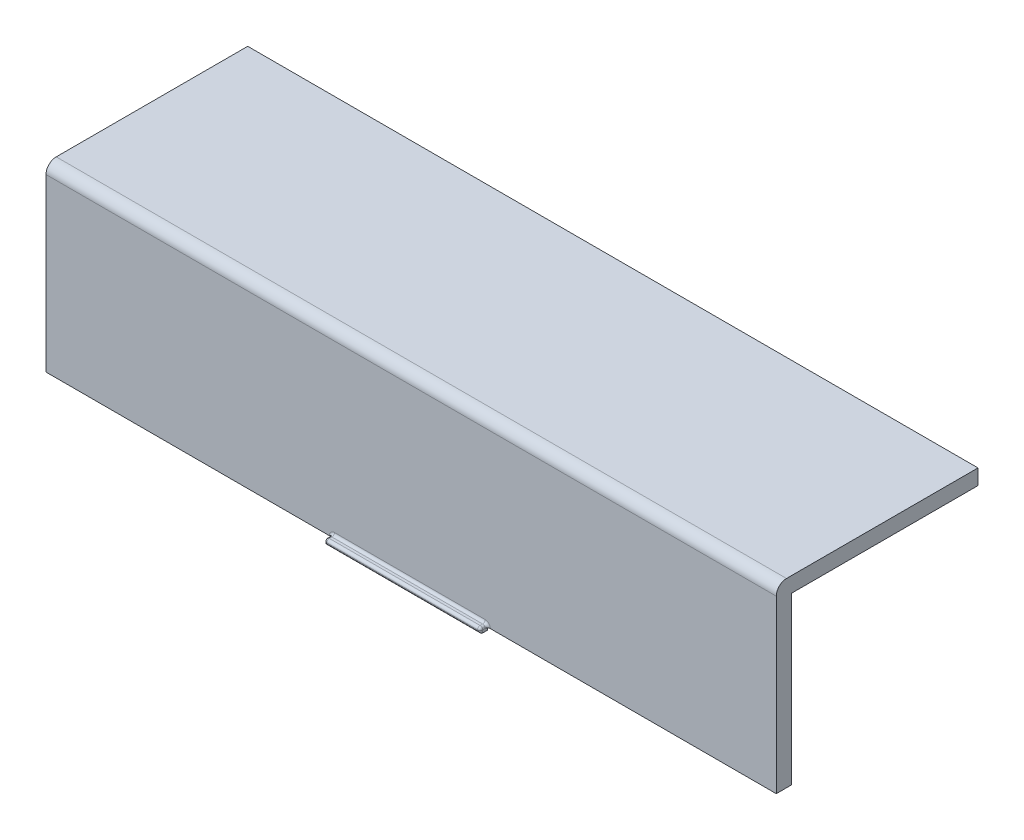
ISO-10303-21;
HEADER;
FILE_DESCRIPTION(('STEP AP214'),'2;1');
FILE_NAME('part.step','',(''),(''),'','','');
FILE_SCHEMA(('AUTOMOTIVE_DESIGN { 1 0 10303 214 1 1 1 1 }'));
ENDSEC;
DATA;
#1=APPLICATION_CONTEXT('core data for automotive mechanical design processes');
#2=APPLICATION_PROTOCOL_DEFINITION('international standard','automotive_design',2000,#1);
#3=PRODUCT_CONTEXT('',#1,'mechanical');
#4=PRODUCT('Part','Part','',(#3));
#5=PRODUCT_RELATED_PRODUCT_CATEGORY('part','',(#4));
#6=PRODUCT_DEFINITION_FORMATION('','',#4);
#7=PRODUCT_DEFINITION_CONTEXT('part definition',#1,'design');
#8=PRODUCT_DEFINITION('design','',#6,#7);
#9=PRODUCT_DEFINITION_SHAPE('','',#8);
#10=(LENGTH_UNIT() NAMED_UNIT(*) SI_UNIT(.MILLI.,.METRE.));
#11=(NAMED_UNIT(*) PLANE_ANGLE_UNIT() SI_UNIT($,.RADIAN.));
#12=(NAMED_UNIT(*) SI_UNIT($,.STERADIAN.) SOLID_ANGLE_UNIT());
#13=UNCERTAINTY_MEASURE_WITH_UNIT(LENGTH_MEASURE(1.E-05),#10,'distance_accuracy_value','');
#14=(GEOMETRIC_REPRESENTATION_CONTEXT(3) GLOBAL_UNCERTAINTY_ASSIGNED_CONTEXT((#13)) GLOBAL_UNIT_ASSIGNED_CONTEXT((#10,
#11,#12)) REPRESENTATION_CONTEXT('',''));
#15=CARTESIAN_POINT('',(0.,0.,0.));
#16=DIRECTION('',(0.,0.,1.));
#17=DIRECTION('',(1.,0.,0.));
#18=AXIS2_PLACEMENT_3D('',#15,#16,#17);
#19=CARTESIAN_POINT('',(-10.5625000000706,-0.499999999999987,41.5));
#20=DIRECTION('',(0.,0.,1.));
#21=DIRECTION('',(1.,0.,0.));
#22=AXIS2_PLACEMENT_3D('',#19,#20,#21);
#23=PLANE('',#22);
#24=DIRECTION('',(0.,1.,0.));
#25=VECTOR('',#24,1.);
#26=CARTESIAN_POINT('',(-10.0625000000706,-0.499999999999987,41.5));
#27=LINE('',#26,#25);
#28=CARTESIAN_POINT('',(-10.0625000000706,0.0307991543217241,41.5));
#29=VERTEX_POINT('',#28);
#30=CARTESIAN_POINT('',(-10.0625000000706,0.,41.5));
#31=VERTEX_POINT('',#30);
#32=EDGE_CURVE('E118',#29,#31,#27,.F.);
#33=ORIENTED_EDGE('',*,*,#32,.T.);
#34=DIRECTION('',(-1.,0.,0.));
#35=VECTOR('',#34,1.);
#36=CARTESIAN_POINT('',(-10.5625000000706,0.,41.5));
#37=LINE('',#36,#35);
#38=CARTESIAN_POINT('',(19.4374999999293,0.,41.5));
#39=VERTEX_POINT('',#38);
#40=EDGE_CURVE('E115',#39,#31,#37,.T.);
#41=ORIENTED_EDGE('',*,*,#40,.F.);
#42=DIRECTION('',(0.,1.,0.));
#43=VECTOR('',#42,1.);
#44=CARTESIAN_POINT('',(19.4374999999293,-0.499999999999987,41.5));
#45=LINE('',#44,#43);
#46=CARTESIAN_POINT('',(19.4374999999293,0.0307991543217248,41.5));
#47=VERTEX_POINT('',#46);
#48=EDGE_CURVE('E91',#39,#47,#45,.T.);
#49=ORIENTED_EDGE('',*,*,#48,.T.);
#50=DIRECTION('',(1.,0.,0.));
#51=VECTOR('',#50,1.);
#52=CARTESIAN_POINT('',(-10.5625000000706,0.0307991543217241,41.5));
#53=LINE('',#52,#51);
#54=EDGE_CURVE('E126',#29,#47,#53,.T.);
#55=ORIENTED_EDGE('',*,*,#54,.F.);
#56=EDGE_LOOP('',(#33,#41,#49,#55));
#57=FACE_BOUND('',#56,.T.);
#58=ADVANCED_FACE('F17',(#57),#23,.T.);
#59=CARTESIAN_POINT('',(-10.5625000000706,0.,41.));
#60=DIRECTION('',(-1.,0.,0.));
#61=DIRECTION('',(0.,0.,1.));
#62=AXIS2_PLACEMENT_3D('',#59,#60,#61);
#63=CYLINDRICAL_SURFACE('',#62,0.5);
#64=CARTESIAN_POINT('',(19.4374999999293,0.,41.));
#65=DIRECTION('',(-0.707106781186547,-0.707106781186547,0.));
#66=DIRECTION('',(-0.707106781186547,0.707106781186547,0.));
#67=AXIS2_PLACEMENT_3D('',#64,#65,#66);
#68=ELLIPSE('',#67,0.707106781186547,0.5);
#69=CARTESIAN_POINT('',(19.9374999999293,-0.499999999999985,41.));
#70=VERTEX_POINT('',#69);
#71=EDGE_CURVE('E20',#70,#39,#68,.T.);
#72=ORIENTED_EDGE('',*,*,#71,.T.);
#73=ORIENTED_EDGE('',*,*,#40,.T.);
#74=CARTESIAN_POINT('',(-10.0625000000706,0.,41.));
#75=DIRECTION('',(-0.707106781186547,0.707106781186547,0.));
#76=DIRECTION('',(0.707106781186547,0.707106781186547,0.));
#77=AXIS2_PLACEMENT_3D('',#74,#75,#76);
#78=ELLIPSE('',#77,0.707106781186547,0.5);
#79=CARTESIAN_POINT('',(-10.5625000000706,-0.499999999999987,41.));
#80=VERTEX_POINT('',#79);
#81=EDGE_CURVE('E157',#80,#31,#78,.T.);
#82=ORIENTED_EDGE('',*,*,#81,.F.);
#83=DIRECTION('',(1.,0.,0.));
#84=VECTOR('',#83,1.);
#85=CARTESIAN_POINT('',(-10.5625000000706,-0.499999999999987,41.));
#86=LINE('',#85,#84);
#87=EDGE_CURVE('E117',#80,#70,#86,.T.);
#88=ORIENTED_EDGE('',*,*,#87,.T.);
#89=EDGE_LOOP('',(#72,#73,#82,#88));
#90=FACE_BOUND('',#89,.T.);
#91=ADVANCED_FACE('F113',(#90),#63,.T.);
#92=CARTESIAN_POINT('',(-10.0625000000706,0.030799154321724,41.));
#93=DIRECTION('',(1.,0.,0.));
#94=DIRECTION('',(0.,1.,0.));
#95=AXIS2_PLACEMENT_3D('',#92,#93,#94);
#96=SPHERICAL_SURFACE('',#95,0.5);
#97=CARTESIAN_POINT('',(-10.0625000000706,0.030799154321724,41.));
#98=DIRECTION('',(0.,1.,0.));
#99=DIRECTION('',(0.,0.,1.));
#100=AXIS2_PLACEMENT_3D('',#97,#98,#99);
#101=CIRCLE('',#100,0.5);
#102=CARTESIAN_POINT('',(-10.5625000000706,0.030799154321724,41.));
#103=VERTEX_POINT('',#102);
#104=EDGE_CURVE('E158',#29,#103,#101,.F.);
#105=ORIENTED_EDGE('',*,*,#104,.F.);
#106=CARTESIAN_POINT('',(-10.0625000000706,0.030799154321724,41.));
#107=DIRECTION('',(1.,0.,0.));
#108=DIRECTION('',(0.,0.,-1.));
#109=AXIS2_PLACEMENT_3D('',#106,#107,#108);
#110=CIRCLE('',#109,0.5);
#111=CARTESIAN_POINT('',(-10.0625000000706,0.530799154321724,41.));
#112=VERTEX_POINT('',#111);
#113=EDGE_CURVE('E108',#112,#29,#110,.T.);
#114=ORIENTED_EDGE('',*,*,#113,.F.);
#115=CARTESIAN_POINT('',(-10.0625000000706,0.030799154321724,41.));
#116=DIRECTION('',(0.,0.,-1.));
#117=DIRECTION('',(-1.,0.,0.));
#118=AXIS2_PLACEMENT_3D('',#115,#116,#117);
#119=CIRCLE('',#118,0.5);
#120=EDGE_CURVE('E100',#103,#112,#119,.T.);
#121=ORIENTED_EDGE('',*,*,#120,.F.);
#122=EDGE_LOOP('',(#105,#114,#121));
#123=FACE_BOUND('',#122,.T.);
#124=ADVANCED_FACE('F543',(#123),#96,.T.);
#125=CARTESIAN_POINT('',(-10.5625000000706,0.030799154321724,41.));
#126=DIRECTION('',(1.,0.,0.));
#127=DIRECTION('',(0.,0.,-1.));
#128=AXIS2_PLACEMENT_3D('',#125,#126,#127);
#129=CYLINDRICAL_SURFACE('',#128,0.5);
#130=ORIENTED_EDGE('',*,*,#113,.T.);
#131=ORIENTED_EDGE('',*,*,#54,.T.);
#132=CARTESIAN_POINT('',(19.4374999999293,0.030799154321724,41.));
#133=DIRECTION('',(1.,0.,0.));
#134=DIRECTION('',(0.,1.,0.));
#135=AXIS2_PLACEMENT_3D('',#132,#133,#134);
#136=CIRCLE('',#135,0.5);
#137=CARTESIAN_POINT('',(19.4374999999293,0.530799154321724,41.));
#138=VERTEX_POINT('',#137);
#139=EDGE_CURVE('E133',#138,#47,#136,.T.);
#140=ORIENTED_EDGE('',*,*,#139,.F.);
#141=DIRECTION('',(1.,0.,0.));
#142=VECTOR('',#141,1.);
#143=CARTESIAN_POINT('',(19.9374999999293,0.530799154321724,41.));
#144=LINE('',#143,#142);
#145=EDGE_CURVE('E174',#138,#112,#144,.F.);
#146=ORIENTED_EDGE('',*,*,#145,.T.);
#147=EDGE_LOOP('',(#130,#131,#140,#146));
#148=FACE_BOUND('',#147,.T.);
#149=ADVANCED_FACE('F578',(#148),#129,.T.);
#150=CARTESIAN_POINT('',(19.4374999999293,0.030799154321724,41.));
#151=DIRECTION('',(1.,0.,0.));
#152=DIRECTION('',(0.,1.,0.));
#153=AXIS2_PLACEMENT_3D('',#150,#151,#152);
#154=SPHERICAL_SURFACE('',#153,0.5);
#155=CARTESIAN_POINT('',(19.4374999999293,0.030799154321724,41.));
#156=DIRECTION('',(0.,0.,-1.));
#157=DIRECTION('',(-1.,0.,0.));
#158=AXIS2_PLACEMENT_3D('',#155,#156,#157);
#159=CIRCLE('',#158,0.5);
#160=CARTESIAN_POINT('',(19.9374999999293,0.030799154321724,41.));
#161=VERTEX_POINT('',#160);
#162=EDGE_CURVE('E219',#138,#161,#159,.T.);
#163=ORIENTED_EDGE('',*,*,#162,.F.);
#164=ORIENTED_EDGE('',*,*,#139,.T.);
#165=CARTESIAN_POINT('',(19.4374999999293,0.030799154321724,41.));
#166=DIRECTION('',(0.,-1.,0.));
#167=DIRECTION('',(0.,0.,-1.));
#168=AXIS2_PLACEMENT_3D('',#165,#166,#167);
#169=CIRCLE('',#168,0.5);
#170=EDGE_CURVE('E122',#161,#47,#169,.T.);
#171=ORIENTED_EDGE('',*,*,#170,.F.);
#172=EDGE_LOOP('',(#163,#164,#171));
#173=FACE_BOUND('',#172,.T.);
#174=ADVANCED_FACE('F579',(#173),#154,.T.);
#175=CARTESIAN_POINT('',(-10.0625000000706,-0.499999999999987,41.));
#176=DIRECTION('',(0.,1.,0.));
#177=DIRECTION('',(0.,0.,1.));
#178=AXIS2_PLACEMENT_3D('',#175,#176,#177);
#179=CYLINDRICAL_SURFACE('',#178,0.5);
#180=ORIENTED_EDGE('',*,*,#104,.T.);
#181=DIRECTION('',(0.,1.,0.));
#182=VECTOR('',#181,1.);
#183=CARTESIAN_POINT('',(-10.5625000000706,0.530799154321724,41.));
#184=LINE('',#183,#182);
#185=EDGE_CURVE('E190',#103,#80,#184,.F.);
#186=ORIENTED_EDGE('',*,*,#185,.T.);
#187=ORIENTED_EDGE('',*,*,#81,.T.);
#188=ORIENTED_EDGE('',*,*,#32,.F.);
#189=EDGE_LOOP('',(#180,#186,#187,#188));
#190=FACE_BOUND('',#189,.T.);
#191=ADVANCED_FACE('F540',(#190),#179,.T.);
#192=CARTESIAN_POINT('',(-10.5625000000706,-0.499999999999987,41.5));
#193=DIRECTION('',(0.,1.,0.));
#194=DIRECTION('',(0.,0.,1.));
#195=AXIS2_PLACEMENT_3D('',#192,#193,#194);
#196=PLANE('',#195);
#197=ORIENTED_EDGE('',*,*,#87,.F.);
#198=DIRECTION('',(0.,0.,-1.));
#199=VECTOR('',#198,1.);
#200=CARTESIAN_POINT('',(-10.5625000000706,-0.499999999999987,41.5));
#201=LINE('',#200,#199);
#202=CARTESIAN_POINT('',(-10.5625000000706,-0.499999999999987,40.));
#203=VERTEX_POINT('',#202);
#204=EDGE_CURVE('E192',#80,#203,#201,.T.);
#205=ORIENTED_EDGE('',*,*,#204,.T.);
#206=DIRECTION('',(1.,0.,0.));
#207=VECTOR('',#206,1.);
#208=CARTESIAN_POINT('',(-10.5625000000706,-0.499999999999987,40.));
#209=LINE('',#208,#207);
#210=CARTESIAN_POINT('',(19.9374999999293,-0.499999999999987,40.));
#211=VERTEX_POINT('',#210);
#212=EDGE_CURVE('E203',#203,#211,#209,.T.);
#213=ORIENTED_EDGE('',*,*,#212,.T.);
#214=DIRECTION('',(0.,0.,1.));
#215=VECTOR('',#214,1.);
#216=CARTESIAN_POINT('',(19.9374999999293,-0.499999999999987,41.5));
#217=LINE('',#216,#215);
#218=EDGE_CURVE('E182',#70,#211,#217,.F.);
#219=ORIENTED_EDGE('',*,*,#218,.F.);
#220=EDGE_LOOP('',(#197,#205,#213,#219));
#221=FACE_BOUND('',#220,.T.);
#222=ADVANCED_FACE('F563',(#221),#196,.F.);
#223=CARTESIAN_POINT('',(19.4374999999293,-0.499999999999987,41.));
#224=DIRECTION('',(0.,-1.,0.));
#225=DIRECTION('',(0.,0.,-1.));
#226=AXIS2_PLACEMENT_3D('',#223,#224,#225);
#227=CYLINDRICAL_SURFACE('',#226,0.5);
#228=ORIENTED_EDGE('',*,*,#170,.T.);
#229=ORIENTED_EDGE('',*,*,#48,.F.);
#230=ORIENTED_EDGE('',*,*,#71,.F.);
#231=DIRECTION('',(0.,1.,0.));
#232=VECTOR('',#231,1.);
#233=CARTESIAN_POINT('',(19.9374999999293,-0.499999999999987,41.));
#234=LINE('',#233,#232);
#235=EDGE_CURVE('E213',#70,#161,#234,.T.);
#236=ORIENTED_EDGE('',*,*,#235,.T.);
#237=EDGE_LOOP('',(#228,#229,#230,#236));
#238=FACE_BOUND('',#237,.T.);
#239=ADVANCED_FACE('F120',(#238),#227,.T.);
#240=CARTESIAN_POINT('',(-10.0625000000706,0.030799154321724,41.5));
#241=DIRECTION('',(0.,0.,-1.));
#242=DIRECTION('',(-1.,0.,0.));
#243=AXIS2_PLACEMENT_3D('',#240,#241,#242);
#244=CYLINDRICAL_SURFACE('',#243,0.5);
#245=ORIENTED_EDGE('',*,*,#120,.T.);
#246=DIRECTION('',(0.,0.,-1.));
#247=VECTOR('',#246,1.);
#248=CARTESIAN_POINT('',(-10.0625000000706,0.530799154321724,41.5));
#249=LINE('',#248,#247);
#250=CARTESIAN_POINT('',(-10.0625000000706,0.530799154321722,40.5));
#251=VERTEX_POINT('',#250);
#252=EDGE_CURVE('E176',#112,#251,#249,.T.);
#253=ORIENTED_EDGE('',*,*,#252,.T.);
#254=CARTESIAN_POINT('',(-10.0625000000706,0.030799154321724,40.5));
#255=DIRECTION('',(0.,0.,1.));
#256=DIRECTION('',(1.,0.,0.));
#257=AXIS2_PLACEMENT_3D('',#254,#255,#256);
#258=CIRCLE('',#257,0.499999999999999);
#259=CARTESIAN_POINT('',(-10.5625000000706,0.030799154321724,40.5));
#260=VERTEX_POINT('',#259);
#261=EDGE_CURVE('E229',#251,#260,#258,.T.);
#262=ORIENTED_EDGE('',*,*,#261,.T.);
#263=DIRECTION('',(0.,0.,-1.));
#264=VECTOR('',#263,1.);
#265=CARTESIAN_POINT('',(-10.5625000000706,0.030799154321724,41.5));
#266=LINE('',#265,#264);
#267=EDGE_CURVE('E193',#260,#103,#266,.F.);
#268=ORIENTED_EDGE('',*,*,#267,.T.);
#269=EDGE_LOOP('',(#245,#253,#262,#268));
#270=FACE_BOUND('',#269,.T.);
#271=ADVANCED_FACE('F549',(#270),#244,.T.);
#272=CARTESIAN_POINT('',(19.9374999999293,0.530799154321724,41.5));
#273=DIRECTION('',(0.,-1.,0.));
#274=DIRECTION('',(0.,0.,-1.));
#275=AXIS2_PLACEMENT_3D('',#272,#273,#274);
#276=PLANE('',#275);
#277=ORIENTED_EDGE('',*,*,#145,.F.);
#278=DIRECTION('',(0.,0.,-1.));
#279=VECTOR('',#278,1.);
#280=CARTESIAN_POINT('',(19.4374999999293,0.530799154321724,41.5));
#281=LINE('',#280,#279);
#282=CARTESIAN_POINT('',(19.4374999999293,0.530799154321723,40.5));
#283=VERTEX_POINT('',#282);
#284=EDGE_CURVE('E179',#283,#138,#281,.F.);
#285=ORIENTED_EDGE('',*,*,#284,.F.);
#286=DIRECTION('',(-1.,0.,0.));
#287=VECTOR('',#286,1.);
#288=CARTESIAN_POINT('',(19.9374999999293,0.53079915432172,40.5));
#289=LINE('',#288,#287);
#290=EDGE_CURVE('E240',#283,#251,#289,.T.);
#291=ORIENTED_EDGE('',*,*,#290,.T.);
#292=ORIENTED_EDGE('',*,*,#252,.F.);
#293=EDGE_LOOP('',(#277,#285,#291,#292));
#294=FACE_BOUND('',#293,.T.);
#295=ADVANCED_FACE('F577',(#294),#276,.F.);
#296=CARTESIAN_POINT('',(19.4374999999293,0.030799154321724,41.5));
#297=DIRECTION('',(0.,0.,-1.));
#298=DIRECTION('',(-1.,0.,0.));
#299=AXIS2_PLACEMENT_3D('',#296,#297,#298);
#300=CYLINDRICAL_SURFACE('',#299,0.5);
#301=ORIENTED_EDGE('',*,*,#162,.T.);
#302=DIRECTION('',(0.,0.,1.));
#303=VECTOR('',#302,1.);
#304=CARTESIAN_POINT('',(19.9374999999293,0.030799154321724,41.5));
#305=LINE('',#304,#303);
#306=CARTESIAN_POINT('',(19.9374999999293,0.030799154321724,40.5));
#307=VERTEX_POINT('',#306);
#308=EDGE_CURVE('E215',#161,#307,#305,.F.);
#309=ORIENTED_EDGE('',*,*,#308,.T.);
#310=CARTESIAN_POINT('',(19.4374999999293,0.030799154321724,40.5));
#311=DIRECTION('',(0.,0.,1.));
#312=DIRECTION('',(1.,0.,0.));
#313=AXIS2_PLACEMENT_3D('',#310,#311,#312);
#314=CIRCLE('',#313,0.5);
#315=EDGE_CURVE('E250',#307,#283,#314,.T.);
#316=ORIENTED_EDGE('',*,*,#315,.T.);
#317=ORIENTED_EDGE('',*,*,#284,.T.);
#318=EDGE_LOOP('',(#301,#309,#316,#317));
#319=FACE_BOUND('',#318,.T.);
#320=ADVANCED_FACE('F570',(#319),#300,.T.);
#321=CARTESIAN_POINT('',(-10.5625000000706,0.530799154321724,41.5));
#322=DIRECTION('',(1.,0.,0.));
#323=DIRECTION('',(0.,0.,-1.));
#324=AXIS2_PLACEMENT_3D('',#321,#322,#323);
#325=PLANE('',#324);
#326=ORIENTED_EDGE('',*,*,#185,.F.);
#327=ORIENTED_EDGE('',*,*,#267,.F.);
#328=DIRECTION('',(0.,-1.,0.));
#329=VECTOR('',#328,1.);
#330=CARTESIAN_POINT('',(-10.5625000000706,0.530799154321724,40.5));
#331=LINE('',#330,#329);
#332=CARTESIAN_POINT('',(-10.5625000000706,0.,40.5));
#333=VERTEX_POINT('',#332);
#334=EDGE_CURVE('E233',#260,#333,#331,.T.);
#335=ORIENTED_EDGE('',*,*,#334,.T.);
#336=DIRECTION('',(0.,0.,1.));
#337=VECTOR('',#336,1.);
#338=CARTESIAN_POINT('',(-10.5625000000706,0.,40.));
#339=LINE('',#338,#337);
#340=CARTESIAN_POINT('',(-10.5625000000706,0.,40.));
#341=VERTEX_POINT('',#340);
#342=EDGE_CURVE('E155',#333,#341,#339,.F.);
#343=ORIENTED_EDGE('',*,*,#342,.T.);
#344=DIRECTION('',(0.,1.,0.));
#345=VECTOR('',#344,1.);
#346=CARTESIAN_POINT('',(-10.5625000000706,-0.499999999999987,40.));
#347=LINE('',#346,#345);
#348=EDGE_CURVE('E208',#341,#203,#347,.F.);
#349=ORIENTED_EDGE('',*,*,#348,.T.);
#350=ORIENTED_EDGE('',*,*,#204,.F.);
#351=EDGE_LOOP('',(#326,#327,#335,#343,#349,#350));
#352=FACE_BOUND('',#351,.T.);
#353=ADVANCED_FACE('F547',(#352),#325,.F.);
#354=CARTESIAN_POINT('',(-10.5625000000706,-0.499999999999987,40.));
#355=DIRECTION('',(0.,0.,1.));
#356=DIRECTION('',(1.,0.,0.));
#357=AXIS2_PLACEMENT_3D('',#354,#355,#356);
#358=PLANE('',#357);
#359=DIRECTION('',(1.,0.,0.));
#360=VECTOR('',#359,1.);
#361=CARTESIAN_POINT('',(-66.5625000001413,0.,40.));
#362=LINE('',#361,#360);
#363=CARTESIAN_POINT('',(19.9374999999293,0.,40.));
#364=VERTEX_POINT('',#363);
#365=EDGE_CURVE('E263',#341,#364,#362,.T.);
#366=ORIENTED_EDGE('',*,*,#365,.T.);
#367=DIRECTION('',(0.,1.,0.));
#368=VECTOR('',#367,1.);
#369=CARTESIAN_POINT('',(19.9374999999293,-0.499999999999987,40.));
#370=LINE('',#369,#368);
#371=EDGE_CURVE('E216',#364,#211,#370,.F.);
#372=ORIENTED_EDGE('',*,*,#371,.T.);
#373=ORIENTED_EDGE('',*,*,#212,.F.);
#374=ORIENTED_EDGE('',*,*,#348,.F.);
#375=EDGE_LOOP('',(#366,#372,#373,#374));
#376=FACE_BOUND('',#375,.T.);
#377=ADVANCED_FACE('F561',(#376),#358,.F.);
#378=CARTESIAN_POINT('',(19.9374999999293,-0.499999999999987,41.5));
#379=DIRECTION('',(-1.,0.,0.));
#380=DIRECTION('',(0.,0.,1.));
#381=AXIS2_PLACEMENT_3D('',#378,#379,#380);
#382=PLANE('',#381);
#383=ORIENTED_EDGE('',*,*,#235,.F.);
#384=ORIENTED_EDGE('',*,*,#218,.T.);
#385=ORIENTED_EDGE('',*,*,#371,.F.);
#386=DIRECTION('',(0.,0.,1.));
#387=VECTOR('',#386,1.);
#388=CARTESIAN_POINT('',(19.9374999999293,0.,40.));
#389=LINE('',#388,#387);
#390=CARTESIAN_POINT('',(19.9374999999293,0.,40.5));
#391=VERTEX_POINT('',#390);
#392=EDGE_CURVE('E152',#364,#391,#389,.T.);
#393=ORIENTED_EDGE('',*,*,#392,.T.);
#394=DIRECTION('',(0.,1.,0.));
#395=VECTOR('',#394,1.);
#396=CARTESIAN_POINT('',(19.9374999999293,-0.499999999999987,40.5));
#397=LINE('',#396,#395);
#398=EDGE_CURVE('E272',#391,#307,#397,.T.);
#399=ORIENTED_EDGE('',*,*,#398,.T.);
#400=ORIENTED_EDGE('',*,*,#308,.F.);
#401=EDGE_LOOP('',(#383,#384,#385,#393,#399,#400));
#402=FACE_BOUND('',#401,.T.);
#403=ADVANCED_FACE('F567',(#402),#382,.F.);
#404=CARTESIAN_POINT('',(-11.0625000000706,0.530799154321724,40.5));
#405=DIRECTION('',(0.,-1.,0.));
#406=DIRECTION('',(0.,0.,-1.));
#407=AXIS2_PLACEMENT_3D('',#404,#405,#406);
#408=CYLINDRICAL_SURFACE('',#407,0.5);
#409=ORIENTED_EDGE('',*,*,#334,.F.);
#410=CARTESIAN_POINT('',(-11.0625000000706,0.0307991543217241,40.5));
#411=DIRECTION('',(0.,-1.,0.));
#412=DIRECTION('',(-1.,0.,0.));
#413=AXIS2_PLACEMENT_3D('',#410,#411,#412);
#414=CIRCLE('',#413,0.5);
#415=CARTESIAN_POINT('',(-11.0625000000706,0.0307991543217241,40.));
#416=VERTEX_POINT('',#415);
#417=EDGE_CURVE('E232',#260,#416,#414,.F.);
#418=ORIENTED_EDGE('',*,*,#417,.T.);
#419=DIRECTION('',(0.,1.,0.));
#420=VECTOR('',#419,1.);
#421=CARTESIAN_POINT('',(-11.0625000000706,0.,40.));
#422=LINE('',#421,#420);
#423=CARTESIAN_POINT('',(-11.0625000000706,0.,40.));
#424=VERTEX_POINT('',#423);
#425=EDGE_CURVE('E399',#424,#416,#422,.T.);
#426=ORIENTED_EDGE('',*,*,#425,.F.);
#427=CARTESIAN_POINT('',(-11.0625000000706,0.,40.5));
#428=DIRECTION('',(0.,-1.,0.));
#429=DIRECTION('',(0.,0.,-1.));
#430=AXIS2_PLACEMENT_3D('',#427,#428,#429);
#431=CIRCLE('',#430,0.5);
#432=EDGE_CURVE('E153',#424,#333,#431,.T.);
#433=ORIENTED_EDGE('',*,*,#432,.T.);
#434=EDGE_LOOP('',(#409,#418,#426,#433));
#435=FACE_BOUND('',#434,.T.);
#436=ADVANCED_FACE('F296',(#435),#408,.F.);
#437=CARTESIAN_POINT('',(-10.0625000000706,0.030799154321724,40.5));
#438=DIRECTION('',(0.,0.,1.));
#439=DIRECTION('',(1.,0.,0.));
#440=AXIS2_PLACEMENT_3D('',#437,#438,#439);
#441=TOROIDAL_SURFACE('',#440,0.999999999999999,0.5);
#442=ORIENTED_EDGE('',*,*,#417,.F.);
#443=ORIENTED_EDGE('',*,*,#261,.F.);
#444=CARTESIAN_POINT('',(-10.0625000000706,1.03079915432172,40.5));
#445=DIRECTION('',(-1.,0.,0.));
#446=DIRECTION('',(0.,0.,1.));
#447=AXIS2_PLACEMENT_3D('',#444,#445,#446);
#448=CIRCLE('',#447,0.5);
#449=CARTESIAN_POINT('',(-10.0625000000706,1.03079915432172,40.));
#450=VERTEX_POINT('',#449);
#451=EDGE_CURVE('E243',#251,#450,#448,.F.);
#452=ORIENTED_EDGE('',*,*,#451,.T.);
#453=CARTESIAN_POINT('',(-10.0625000000706,0.030799154321724,40.));
#454=DIRECTION('',(0.,0.,1.));
#455=DIRECTION('',(0.,1.,0.));
#456=AXIS2_PLACEMENT_3D('',#453,#454,#455);
#457=CIRCLE('',#456,0.999999999999999);
#458=EDGE_CURVE('E404',#416,#450,#457,.F.);
#459=ORIENTED_EDGE('',*,*,#458,.F.);
#460=EDGE_LOOP('',(#442,#443,#452,#459));
#461=FACE_BOUND('',#460,.T.);
#462=ADVANCED_FACE('F285',(#461),#441,.F.);
#463=CARTESIAN_POINT('',(19.9374999999293,1.03079915432172,40.5));
#464=DIRECTION('',(-1.,0.,0.));
#465=DIRECTION('',(0.,0.,1.));
#466=AXIS2_PLACEMENT_3D('',#463,#464,#465);
#467=CYLINDRICAL_SURFACE('',#466,0.5);
#468=DIRECTION('',(1.,0.,0.));
#469=VECTOR('',#468,1.);
#470=CARTESIAN_POINT('',(-66.5625000001413,1.03079915432172,40.));
#471=LINE('',#470,#469);
#472=CARTESIAN_POINT('',(19.4374999999293,1.03079915432172,40.));
#473=VERTEX_POINT('',#472);
#474=EDGE_CURVE('E407',#450,#473,#471,.T.);
#475=ORIENTED_EDGE('',*,*,#474,.F.);
#476=ORIENTED_EDGE('',*,*,#451,.F.);
#477=ORIENTED_EDGE('',*,*,#290,.F.);
#478=CARTESIAN_POINT('',(19.4374999999293,1.03079915432172,40.5));
#479=DIRECTION('',(-1.,0.,0.));
#480=DIRECTION('',(0.,1.,0.));
#481=AXIS2_PLACEMENT_3D('',#478,#479,#480);
#482=CIRCLE('',#481,0.5);
#483=EDGE_CURVE('E253',#283,#473,#482,.F.);
#484=ORIENTED_EDGE('',*,*,#483,.T.);
#485=EDGE_LOOP('',(#475,#476,#477,#484));
#486=FACE_BOUND('',#485,.T.);
#487=ADVANCED_FACE('F295',(#486),#467,.F.);
#488=CARTESIAN_POINT('',(19.4374999999293,0.030799154321724,40.5));
#489=DIRECTION('',(0.,0.,1.));
#490=DIRECTION('',(1.,0.,0.));
#491=AXIS2_PLACEMENT_3D('',#488,#489,#490);
#492=TOROIDAL_SURFACE('',#491,1.,0.5);
#493=ORIENTED_EDGE('',*,*,#483,.F.);
#494=ORIENTED_EDGE('',*,*,#315,.F.);
#495=CARTESIAN_POINT('',(20.4374999999293,0.030799154321724,40.5));
#496=DIRECTION('',(0.,1.,0.));
#497=DIRECTION('',(0.,0.,1.));
#498=AXIS2_PLACEMENT_3D('',#495,#496,#497);
#499=CIRCLE('',#498,0.5);
#500=CARTESIAN_POINT('',(20.4374999999293,0.030799154321724,40.));
#501=VERTEX_POINT('',#500);
#502=EDGE_CURVE('E156',#307,#501,#499,.F.);
#503=ORIENTED_EDGE('',*,*,#502,.T.);
#504=CARTESIAN_POINT('',(19.4374999999293,0.030799154321724,40.));
#505=DIRECTION('',(0.,0.,1.));
#506=DIRECTION('',(1.,0.,0.));
#507=AXIS2_PLACEMENT_3D('',#504,#505,#506);
#508=CIRCLE('',#507,0.999999999999997);
#509=EDGE_CURVE('E410',#473,#501,#508,.F.);
#510=ORIENTED_EDGE('',*,*,#509,.F.);
#511=EDGE_LOOP('',(#493,#494,#503,#510));
#512=FACE_BOUND('',#511,.T.);
#513=ADVANCED_FACE('F315',(#512),#492,.F.);
#514=CARTESIAN_POINT('',(20.4374999999293,-0.499999999999987,40.5));
#515=DIRECTION('',(0.,1.,0.));
#516=DIRECTION('',(0.,0.,1.));
#517=AXIS2_PLACEMENT_3D('',#514,#515,#516);
#518=CYLINDRICAL_SURFACE('',#517,0.5);
#519=DIRECTION('',(0.,1.,0.));
#520=VECTOR('',#519,1.);
#521=CARTESIAN_POINT('',(20.4374999999293,0.,40.));
#522=LINE('',#521,#520);
#523=CARTESIAN_POINT('',(20.4374999999293,0.,40.));
#524=VERTEX_POINT('',#523);
#525=EDGE_CURVE('E355',#501,#524,#522,.F.);
#526=ORIENTED_EDGE('',*,*,#525,.F.);
#527=ORIENTED_EDGE('',*,*,#502,.F.);
#528=ORIENTED_EDGE('',*,*,#398,.F.);
#529=CARTESIAN_POINT('',(20.4374999999293,0.,40.5));
#530=DIRECTION('',(0.,1.,0.));
#531=DIRECTION('',(0.,0.,1.));
#532=AXIS2_PLACEMENT_3D('',#529,#530,#531);
#533=CIRCLE('',#532,0.5);
#534=EDGE_CURVE('E148',#391,#524,#533,.F.);
#535=ORIENTED_EDGE('',*,*,#534,.T.);
#536=EDGE_LOOP('',(#526,#527,#528,#535));
#537=FACE_BOUND('',#536,.T.);
#538=ADVANCED_FACE('F324',(#537),#518,.F.);
#539=CARTESIAN_POINT('',(-66.5625000001413,0.,40.));
#540=DIRECTION('',(0.,1.,0.));
#541=DIRECTION('',(0.,0.,1.));
#542=AXIS2_PLACEMENT_3D('',#539,#540,#541);
#543=PLANE('',#542);
#544=DIRECTION('',(1.,0.,0.));
#545=VECTOR('',#544,1.);
#546=CARTESIAN_POINT('',(-66.5625000001413,0.,37.));
#547=LINE('',#546,#545);
#548=CARTESIAN_POINT('',(-66.5625000001413,0.,37.));
#549=VERTEX_POINT('',#548);
#550=CARTESIAN_POINT('',(76.4374999998587,0.,37.));
#551=VERTEX_POINT('',#550);
#552=EDGE_CURVE('E151',#549,#551,#547,.T.);
#553=ORIENTED_EDGE('',*,*,#552,.T.);
#554=DIRECTION('',(0.,0.,1.));
#555=VECTOR('',#554,1.);
#556=CARTESIAN_POINT('',(76.4374999998587,0.,40.));
#557=LINE('',#556,#555);
#558=CARTESIAN_POINT('',(76.4374999998587,0.,40.));
#559=VERTEX_POINT('',#558);
#560=EDGE_CURVE('E344',#551,#559,#557,.T.);
#561=ORIENTED_EDGE('',*,*,#560,.T.);
#562=DIRECTION('',(1.,0.,0.));
#563=VECTOR('',#562,1.);
#564=CARTESIAN_POINT('',(-66.5625000001413,0.,40.));
#565=LINE('',#564,#563);
#566=EDGE_CURVE('E351',#524,#559,#565,.T.);
#567=ORIENTED_EDGE('',*,*,#566,.F.);
#568=ORIENTED_EDGE('',*,*,#534,.F.);
#569=ORIENTED_EDGE('',*,*,#392,.F.);
#570=ORIENTED_EDGE('',*,*,#365,.F.);
#571=ORIENTED_EDGE('',*,*,#342,.F.);
#572=ORIENTED_EDGE('',*,*,#432,.F.);
#573=DIRECTION('',(1.,0.,0.));
#574=VECTOR('',#573,1.);
#575=CARTESIAN_POINT('',(-66.5625000001413,0.,40.));
#576=LINE('',#575,#574);
#577=CARTESIAN_POINT('',(-66.5625000001413,0.,40.));
#578=VERTEX_POINT('',#577);
#579=EDGE_CURVE('E380',#578,#424,#576,.T.);
#580=ORIENTED_EDGE('',*,*,#579,.F.);
#581=DIRECTION('',(0.,0.,-1.));
#582=VECTOR('',#581,1.);
#583=CARTESIAN_POINT('',(-66.5625000001413,0.,40.));
#584=LINE('',#583,#582);
#585=EDGE_CURVE('E375',#578,#549,#584,.T.);
#586=ORIENTED_EDGE('',*,*,#585,.T.);
#587=EDGE_LOOP('',(#553,#561,#567,#568,#569,#570,#571,#572,#580,#586));
#588=FACE_BOUND('',#587,.T.);
#589=ADVANCED_FACE('F557',(#588),#543,.F.);
#590=CARTESIAN_POINT('',(-66.5625000001413,0.,37.));
#591=DIRECTION('',(0.,0.,1.));
#592=DIRECTION('',(1.,0.,0.));
#593=AXIS2_PLACEMENT_3D('',#590,#591,#592);
#594=PLANE('',#593);
#595=DIRECTION('',(1.,0.,0.));
#596=VECTOR('',#595,1.);
#597=CARTESIAN_POINT('',(76.4374999998587,32.5,37.));
#598=LINE('',#597,#596);
#599=CARTESIAN_POINT('',(76.4374999998587,32.5,37.));
#600=VERTEX_POINT('',#599);
#601=CARTESIAN_POINT('',(-66.5625000001413,32.5,37.));
#602=VERTEX_POINT('',#601);
#603=EDGE_CURVE('E368',#600,#602,#598,.F.);
#604=ORIENTED_EDGE('',*,*,#603,.F.);
#605=DIRECTION('',(0.,1.,0.));
#606=VECTOR('',#605,1.);
#607=CARTESIAN_POINT('',(76.4374999998587,0.,37.));
#608=LINE('',#607,#606);
#609=EDGE_CURVE('E338',#600,#551,#608,.F.);
#610=ORIENTED_EDGE('',*,*,#609,.T.);
#611=ORIENTED_EDGE('',*,*,#552,.F.);
#612=DIRECTION('',(0.,1.,0.));
#613=VECTOR('',#612,1.);
#614=CARTESIAN_POINT('',(-66.5625000001413,35.5,37.));
#615=LINE('',#614,#613);
#616=EDGE_CURVE('E371',#549,#602,#615,.T.);
#617=ORIENTED_EDGE('',*,*,#616,.T.);
#618=EDGE_LOOP('',(#604,#610,#611,#617));
#619=FACE_BOUND('',#618,.T.);
#620=ADVANCED_FACE('F615',(#619),#594,.F.);
#621=CARTESIAN_POINT('',(76.4374999998587,32.5,40.));
#622=DIRECTION('',(0.,-1.,0.));
#623=DIRECTION('',(0.,0.,-1.));
#624=AXIS2_PLACEMENT_3D('',#621,#622,#623);
#625=PLANE('',#624);
#626=ORIENTED_EDGE('',*,*,#603,.T.);
#627=DIRECTION('',(0.,0.,-1.));
#628=VECTOR('',#627,1.);
#629=CARTESIAN_POINT('',(-66.5625000001413,32.5,40.));
#630=LINE('',#629,#628);
#631=CARTESIAN_POINT('',(-66.5625000001413,32.5,0.500000000000007));
#632=VERTEX_POINT('',#631);
#633=EDGE_CURVE('E374',#602,#632,#630,.T.);
#634=ORIENTED_EDGE('',*,*,#633,.T.);
#635=DIRECTION('',(1.,0.,0.));
#636=VECTOR('',#635,1.);
#637=CARTESIAN_POINT('',(-66.5625000001413,32.5,0.500000000000007));
#638=LINE('',#637,#636);
#639=CARTESIAN_POINT('',(76.4374999998587,32.5,0.500000000000007));
#640=VERTEX_POINT('',#639);
#641=EDGE_CURVE('E354',#632,#640,#638,.T.);
#642=ORIENTED_EDGE('',*,*,#641,.T.);
#643=DIRECTION('',(0.,0.,1.));
#644=VECTOR('',#643,1.);
#645=CARTESIAN_POINT('',(76.4374999998587,32.5,40.));
#646=LINE('',#645,#644);
#647=EDGE_CURVE('E335',#640,#600,#646,.T.);
#648=ORIENTED_EDGE('',*,*,#647,.T.);
#649=EDGE_LOOP('',(#626,#634,#642,#648));
#650=FACE_BOUND('',#649,.T.);
#651=ADVANCED_FACE('F431',(#650),#625,.T.);
#652=CARTESIAN_POINT('',(-66.5625000001413,0.,40.));
#653=DIRECTION('',(0.,0.,1.));
#654=DIRECTION('',(1.,0.,0.));
#655=AXIS2_PLACEMENT_3D('',#652,#653,#654);
#656=PLANE('',#655);
#657=ORIENTED_EDGE('',*,*,#525,.T.);
#658=ORIENTED_EDGE('',*,*,#566,.T.);
#659=DIRECTION('',(0.,1.,0.));
#660=VECTOR('',#659,1.);
#661=CARTESIAN_POINT('',(76.4374999998587,0.,40.));
#662=LINE('',#661,#660);
#663=CARTESIAN_POINT('',(76.4374999998587,33.5,40.));
#664=VERTEX_POINT('',#663);
#665=EDGE_CURVE('E147',#559,#664,#662,.T.);
#666=ORIENTED_EDGE('',*,*,#665,.T.);
#667=DIRECTION('',(1.,0.,0.));
#668=VECTOR('',#667,1.);
#669=CARTESIAN_POINT('',(-66.5625000001413,33.5,40.));
#670=LINE('',#669,#668);
#671=CARTESIAN_POINT('',(-66.5625000001413,33.5,40.));
#672=VERTEX_POINT('',#671);
#673=EDGE_CURVE('E146',#672,#664,#670,.T.);
#674=ORIENTED_EDGE('',*,*,#673,.F.);
#675=DIRECTION('',(0.,1.,0.));
#676=VECTOR('',#675,1.);
#677=CARTESIAN_POINT('',(-66.5625000001413,35.5,40.));
#678=LINE('',#677,#676);
#679=EDGE_CURVE('E142',#672,#578,#678,.F.);
#680=ORIENTED_EDGE('',*,*,#679,.T.);
#681=ORIENTED_EDGE('',*,*,#579,.T.);
#682=ORIENTED_EDGE('',*,*,#425,.T.);
#683=ORIENTED_EDGE('',*,*,#458,.T.);
#684=ORIENTED_EDGE('',*,*,#474,.T.);
#685=ORIENTED_EDGE('',*,*,#509,.T.);
#686=EDGE_LOOP('',(#657,#658,#666,#674,#680,#681,#682,#683,#684,#685));
#687=FACE_BOUND('',#686,.T.);
#688=ADVANCED_FACE('F420',(#687),#656,.T.);
#689=CARTESIAN_POINT('',(-66.5625000001413,0.,0.500000000000007));
#690=DIRECTION('',(0.,0.,1.));
#691=DIRECTION('',(1.,0.,0.));
#692=AXIS2_PLACEMENT_3D('',#689,#690,#691);
#693=PLANE('',#692);
#694=ORIENTED_EDGE('',*,*,#641,.F.);
#695=DIRECTION('',(0.,1.,0.));
#696=VECTOR('',#695,1.);
#697=CARTESIAN_POINT('',(-66.5625000001413,35.5,0.500000000000007));
#698=LINE('',#697,#696);
#699=CARTESIAN_POINT('',(-66.5625000001413,35.5,0.500000000000007));
#700=VERTEX_POINT('',#699);
#701=EDGE_CURVE('E143',#632,#700,#698,.T.);
#702=ORIENTED_EDGE('',*,*,#701,.T.);
#703=DIRECTION('',(1.,0.,0.));
#704=VECTOR('',#703,1.);
#705=CARTESIAN_POINT('',(76.4374999998587,35.5,0.500000000000007));
#706=LINE('',#705,#704);
#707=CARTESIAN_POINT('',(76.4374999998587,35.5,0.500000000000007));
#708=VERTEX_POINT('',#707);
#709=EDGE_CURVE('E459',#700,#708,#706,.T.);
#710=ORIENTED_EDGE('',*,*,#709,.T.);
#711=DIRECTION('',(0.,1.,0.));
#712=VECTOR('',#711,1.);
#713=CARTESIAN_POINT('',(76.4374999998587,0.,0.500000000000007));
#714=LINE('',#713,#712);
#715=EDGE_CURVE('E339',#708,#640,#714,.F.);
#716=ORIENTED_EDGE('',*,*,#715,.T.);
#717=EDGE_LOOP('',(#694,#702,#710,#716));
#718=FACE_BOUND('',#717,.T.);
#719=ADVANCED_FACE('F430',(#718),#693,.F.);
#720=CARTESIAN_POINT('',(76.4374999998587,0.,40.));
#721=DIRECTION('',(-1.,0.,0.));
#722=DIRECTION('',(0.,0.,1.));
#723=AXIS2_PLACEMENT_3D('',#720,#721,#722);
#724=PLANE('',#723);
#725=CARTESIAN_POINT('',(76.4374999998587,33.5,38.));
#726=DIRECTION('',(1.,0.,0.));
#727=DIRECTION('',(0.,0.,-1.));
#728=AXIS2_PLACEMENT_3D('',#725,#726,#727);
#729=CIRCLE('',#728,2.);
#730=CARTESIAN_POINT('',(76.4374999998587,35.5,38.));
#731=VERTEX_POINT('',#730);
#732=EDGE_CURVE('E144',#664,#731,#729,.F.);
#733=ORIENTED_EDGE('',*,*,#732,.F.);
#734=ORIENTED_EDGE('',*,*,#665,.F.);
#735=ORIENTED_EDGE('',*,*,#560,.F.);
#736=ORIENTED_EDGE('',*,*,#609,.F.);
#737=ORIENTED_EDGE('',*,*,#647,.F.);
#738=ORIENTED_EDGE('',*,*,#715,.F.);
#739=DIRECTION('',(0.,0.,-1.));
#740=VECTOR('',#739,1.);
#741=CARTESIAN_POINT('',(76.4374999998587,35.5,40.));
#742=LINE('',#741,#740);
#743=EDGE_CURVE('E456',#708,#731,#742,.F.);
#744=ORIENTED_EDGE('',*,*,#743,.T.);
#745=EDGE_LOOP('',(#733,#734,#735,#736,#737,#738,#744));
#746=FACE_BOUND('',#745,.T.);
#747=ADVANCED_FACE('F492',(#746),#724,.F.);
#748=CARTESIAN_POINT('',(-66.5625000001413,33.5,38.));
#749=DIRECTION('',(1.,0.,0.));
#750=DIRECTION('',(0.,0.,-1.));
#751=AXIS2_PLACEMENT_3D('',#748,#749,#750);
#752=CYLINDRICAL_SURFACE('',#751,2.);
#753=CARTESIAN_POINT('',(-66.5625000001413,33.5,38.));
#754=DIRECTION('',(1.,0.,0.));
#755=DIRECTION('',(0.,0.,-1.));
#756=AXIS2_PLACEMENT_3D('',#753,#754,#755);
#757=CIRCLE('',#756,2.);
#758=CARTESIAN_POINT('',(-66.5625000001413,35.5,38.));
#759=VERTEX_POINT('',#758);
#760=EDGE_CURVE('E34',#759,#672,#757,.T.);
#761=ORIENTED_EDGE('',*,*,#760,.T.);
#762=ORIENTED_EDGE('',*,*,#673,.T.);
#763=ORIENTED_EDGE('',*,*,#732,.T.);
#764=DIRECTION('',(1.,0.,0.));
#765=VECTOR('',#764,1.);
#766=CARTESIAN_POINT('',(76.4374999998587,35.5,38.));
#767=LINE('',#766,#765);
#768=EDGE_CURVE('E26',#731,#759,#767,.F.);
#769=ORIENTED_EDGE('',*,*,#768,.T.);
#770=EDGE_LOOP('',(#761,#762,#763,#769));
#771=FACE_BOUND('',#770,.T.);
#772=ADVANCED_FACE('F483',(#771),#752,.T.);
#773=CARTESIAN_POINT('',(-66.5625000001413,35.5,40.));
#774=DIRECTION('',(1.,0.,0.));
#775=DIRECTION('',(0.,0.,-1.));
#776=AXIS2_PLACEMENT_3D('',#773,#774,#775);
#777=PLANE('',#776);
#778=ORIENTED_EDGE('',*,*,#760,.F.);
#779=DIRECTION('',(0.,0.,-1.));
#780=VECTOR('',#779,1.);
#781=CARTESIAN_POINT('',(-66.5625000001413,35.5,40.));
#782=LINE('',#781,#780);
#783=EDGE_CURVE('E11',#759,#700,#782,.T.);
#784=ORIENTED_EDGE('',*,*,#783,.T.);
#785=ORIENTED_EDGE('',*,*,#701,.F.);
#786=ORIENTED_EDGE('',*,*,#633,.F.);
#787=ORIENTED_EDGE('',*,*,#616,.F.);
#788=ORIENTED_EDGE('',*,*,#585,.F.);
#789=ORIENTED_EDGE('',*,*,#679,.F.);
#790=EDGE_LOOP('',(#778,#784,#785,#786,#787,#788,#789));
#791=FACE_BOUND('',#790,.T.);
#792=ADVANCED_FACE('F480',(#791),#777,.F.);
#793=CARTESIAN_POINT('',(76.4374999998587,35.5,40.));
#794=DIRECTION('',(0.,-1.,0.));
#795=DIRECTION('',(0.,0.,-1.));
#796=AXIS2_PLACEMENT_3D('',#793,#794,#795);
#797=PLANE('',#796);
#798=ORIENTED_EDGE('',*,*,#768,.F.);
#799=ORIENTED_EDGE('',*,*,#743,.F.);
#800=ORIENTED_EDGE('',*,*,#709,.F.);
#801=ORIENTED_EDGE('',*,*,#783,.F.);
#802=EDGE_LOOP('',(#798,#799,#800,#801));
#803=FACE_BOUND('',#802,.T.);
#804=ADVANCED_FACE('F488',(#803),#797,.F.);
#805=CLOSED_SHELL('',(#58,#91,#124,#149,#174,#191,#222,#239,#271,#295,#320,#353,#377,#403,#436,
#462,#487,#513,#538,#589,#620,#651,#688,#719,#747,#772,#792,#804));
#806=MANIFOLD_SOLID_BREP('B1',#805);
#807=ADVANCED_BREP_SHAPE_REPRESENTATION('',(#18,#806),#14);
#808=SHAPE_DEFINITION_REPRESENTATION(#9,#807);
ENDSEC;
END-ISO-10303-21;
